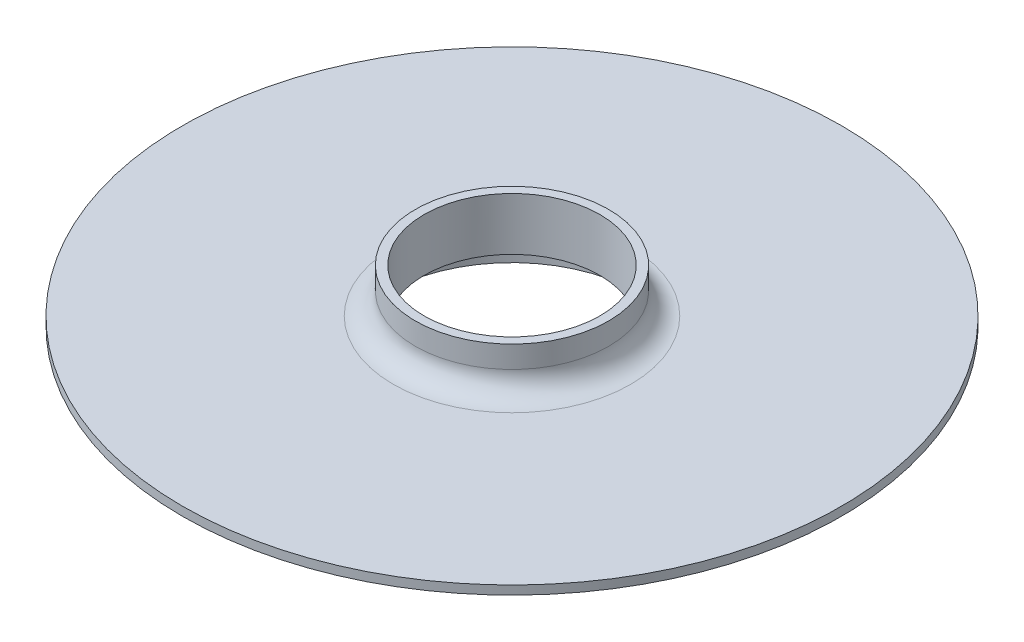
ISO-10303-21;
HEADER;
FILE_DESCRIPTION(('STEP AP214'),'2;1');
FILE_NAME('part.step','',(''),(''),'','','');
FILE_SCHEMA(('AUTOMOTIVE_DESIGN { 1 0 10303 214 1 1 1 1 }'));
ENDSEC;
DATA;
#1=APPLICATION_CONTEXT('core data for automotive mechanical design processes');
#2=APPLICATION_PROTOCOL_DEFINITION('international standard','automotive_design',2000,#1);
#3=PRODUCT_CONTEXT('',#1,'mechanical');
#4=PRODUCT('Part','Part','',(#3));
#5=PRODUCT_RELATED_PRODUCT_CATEGORY('part','',(#4));
#6=PRODUCT_DEFINITION_FORMATION('','',#4);
#7=PRODUCT_DEFINITION_CONTEXT('part definition',#1,'design');
#8=PRODUCT_DEFINITION('design','',#6,#7);
#9=PRODUCT_DEFINITION_SHAPE('','',#8);
#10=(LENGTH_UNIT() NAMED_UNIT(*) SI_UNIT(.MILLI.,.METRE.));
#11=(NAMED_UNIT(*) PLANE_ANGLE_UNIT() SI_UNIT($,.RADIAN.));
#12=(NAMED_UNIT(*) SI_UNIT($,.STERADIAN.) SOLID_ANGLE_UNIT());
#13=UNCERTAINTY_MEASURE_WITH_UNIT(LENGTH_MEASURE(1.E-05),#10,'distance_accuracy_value','');
#14=(GEOMETRIC_REPRESENTATION_CONTEXT(3) GLOBAL_UNCERTAINTY_ASSIGNED_CONTEXT((#13)) GLOBAL_UNIT_ASSIGNED_CONTEXT((#10,
#11,#12)) REPRESENTATION_CONTEXT('',''));
#15=CARTESIAN_POINT('',(0.,0.,0.));
#16=DIRECTION('',(0.,0.,1.));
#17=DIRECTION('',(1.,0.,0.));
#18=AXIS2_PLACEMENT_3D('',#15,#16,#17);
#19=CARTESIAN_POINT('',(0.,2.,0.));
#20=DIRECTION('',(0.,1.,0.));
#21=DIRECTION('',(0.,0.,1.));
#22=AXIS2_PLACEMENT_3D('',#19,#20,#21);
#23=PLANE('',#22);
#24=CARTESIAN_POINT('',(0.,2.,0.));
#25=DIRECTION('',(0.,1.,0.));
#26=DIRECTION('',(0.,0.,1.));
#27=AXIS2_PLACEMENT_3D('',#24,#25,#26);
#28=CIRCLE('',#27,27.);
#29=CARTESIAN_POINT('',(0.,2.,27.));
#30=VERTEX_POINT('',#29);
#31=EDGE_CURVE('E11',#30,#30,#28,.F.);
#32=ORIENTED_EDGE('',*,*,#31,.T.);
#33=EDGE_LOOP('',(#32));
#34=FACE_BOUND('',#33,.T.);
#35=CARTESIAN_POINT('',(0.,2.,0.));
#36=DIRECTION('',(0.,1.,0.));
#37=DIRECTION('',(0.,0.,1.));
#38=AXIS2_PLACEMENT_3D('',#35,#36,#37);
#39=CIRCLE('',#38,75.);
#40=CARTESIAN_POINT('',(0.,2.,75.));
#41=VERTEX_POINT('',#40);
#42=EDGE_CURVE('E71',#41,#41,#39,.T.);
#43=ORIENTED_EDGE('',*,*,#42,.T.);
#44=EDGE_LOOP('',(#43));
#45=FACE_BOUND('',#44,.T.);
#46=ADVANCED_FACE('F53',(#34,#45),#23,.T.);
#47=CARTESIAN_POINT('',(0.,2.,0.));
#48=DIRECTION('',(0.,-1.,0.));
#49=DIRECTION('',(0.,0.,-1.));
#50=AXIS2_PLACEMENT_3D('',#47,#48,#49);
#51=CYLINDRICAL_SURFACE('',#50,75.);
#52=ORIENTED_EDGE('',*,*,#42,.F.);
#53=EDGE_LOOP('',(#52));
#54=FACE_BOUND('',#53,.T.);
#55=CARTESIAN_POINT('',(0.,0.,0.));
#56=DIRECTION('',(0.,1.,0.));
#57=DIRECTION('',(0.,0.,1.));
#58=AXIS2_PLACEMENT_3D('',#55,#56,#57);
#59=CIRCLE('',#58,75.);
#60=CARTESIAN_POINT('',(0.,0.,75.));
#61=VERTEX_POINT('',#60);
#62=EDGE_CURVE('E74',#61,#61,#59,.T.);
#63=ORIENTED_EDGE('',*,*,#62,.T.);
#64=EDGE_LOOP('',(#63));
#65=FACE_BOUND('',#64,.T.);
#66=ADVANCED_FACE('F122',(#54,#65),#51,.T.);
#67=CARTESIAN_POINT('',(0.,0.,0.));
#68=DIRECTION('',(0.,1.,0.));
#69=DIRECTION('',(0.,0.,1.));
#70=AXIS2_PLACEMENT_3D('',#67,#68,#69);
#71=PLANE('',#70);
#72=CARTESIAN_POINT('',(0.,0.,0.));
#73=DIRECTION('',(0.,1.,0.));
#74=DIRECTION('',(0.,0.,1.));
#75=AXIS2_PLACEMENT_3D('',#72,#73,#74);
#76=CIRCLE('',#75,31.);
#77=CARTESIAN_POINT('',(0.,0.,31.));
#78=VERTEX_POINT('',#77);
#79=EDGE_CURVE('E66',#78,#78,#76,.F.);
#80=ORIENTED_EDGE('',*,*,#79,.F.);
#81=EDGE_LOOP('',(#80));
#82=FACE_BOUND('',#81,.T.);
#83=ORIENTED_EDGE('',*,*,#62,.F.);
#84=EDGE_LOOP('',(#83));
#85=FACE_BOUND('',#84,.T.);
#86=ADVANCED_FACE('F128',(#82,#85),#71,.F.);
#87=CARTESIAN_POINT('',(0.,-8.,0.));
#88=DIRECTION('',(0.,-1.,0.));
#89=DIRECTION('',(0.,0.,-1.));
#90=AXIS2_PLACEMENT_3D('',#87,#88,#89);
#91=PLANE('',#90);
#92=CARTESIAN_POINT('',(0.,-8.,0.));
#93=DIRECTION('',(0.,-1.,0.));
#94=DIRECTION('',(1.,0.,0.));
#95=AXIS2_PLACEMENT_3D('',#92,#93,#94);
#96=CIRCLE('',#95,31.);
#97=CARTESIAN_POINT('',(31.,-8.,0.));
#98=VERTEX_POINT('',#97);
#99=EDGE_CURVE('E78',#98,#98,#96,.T.);
#100=ORIENTED_EDGE('',*,*,#99,.T.);
#101=EDGE_LOOP('',(#100));
#102=FACE_BOUND('',#101,.T.);
#103=CARTESIAN_POINT('',(0.,-8.,0.));
#104=DIRECTION('',(0.,-1.,0.));
#105=DIRECTION('',(0.,0.,-1.));
#106=AXIS2_PLACEMENT_3D('',#103,#104,#105);
#107=CIRCLE('',#106,29.);
#108=CARTESIAN_POINT('',(0.,-8.,-29.));
#109=VERTEX_POINT('',#108);
#110=EDGE_CURVE('E85',#109,#109,#107,.T.);
#111=ORIENTED_EDGE('',*,*,#110,.F.);
#112=EDGE_LOOP('',(#111));
#113=FACE_BOUND('',#112,.T.);
#114=ADVANCED_FACE('F136',(#102,#113),#91,.T.);
#115=CARTESIAN_POINT('',(0.,-8.,0.));
#116=DIRECTION('',(0.,1.,0.));
#117=DIRECTION('',(0.,0.,1.));
#118=AXIS2_PLACEMENT_3D('',#115,#116,#117);
#119=CYLINDRICAL_SURFACE('',#118,31.);
#120=ORIENTED_EDGE('',*,*,#99,.F.);
#121=EDGE_LOOP('',(#120));
#122=FACE_BOUND('',#121,.T.);
#123=ORIENTED_EDGE('',*,*,#79,.T.);
#124=EDGE_LOOP('',(#123));
#125=FACE_BOUND('',#124,.T.);
#126=ADVANCED_FACE('F133',(#122,#125),#119,.T.);
#127=CARTESIAN_POINT('',(0.,-8.,0.));
#128=DIRECTION('',(0.,1.,0.));
#129=DIRECTION('',(0.,0.,1.));
#130=AXIS2_PLACEMENT_3D('',#127,#128,#129);
#131=CYLINDRICAL_SURFACE('',#130,29.);
#132=ORIENTED_EDGE('',*,*,#110,.T.);
#133=EDGE_LOOP('',(#132));
#134=FACE_BOUND('',#133,.T.);
#135=CARTESIAN_POINT('',(0.,0.,0.));
#136=DIRECTION('',(0.,-1.,0.));
#137=DIRECTION('',(0.,0.,-1.));
#138=AXIS2_PLACEMENT_3D('',#135,#136,#137);
#139=CIRCLE('',#138,29.);
#140=CARTESIAN_POINT('',(0.,0.,-29.));
#141=VERTEX_POINT('',#140);
#142=EDGE_CURVE('E86',#141,#141,#139,.T.);
#143=ORIENTED_EDGE('',*,*,#142,.F.);
#144=EDGE_LOOP('',(#143));
#145=FACE_BOUND('',#144,.T.);
#146=ADVANCED_FACE('F145',(#134,#145),#131,.F.);
#147=CARTESIAN_POINT('',(0.,0.,0.));
#148=DIRECTION('',(0.,-1.,0.));
#149=DIRECTION('',(0.,0.,-1.));
#150=AXIS2_PLACEMENT_3D('',#147,#148,#149);
#151=CIRCLE('',#150,20.);
#152=CARTESIAN_POINT('',(0.,0.,-20.));
#153=VERTEX_POINT('',#152);
#154=EDGE_CURVE('E90',#153,#153,#151,.T.);
#155=ORIENTED_EDGE('',*,*,#154,.F.);
#156=EDGE_LOOP('',(#155));
#157=FACE_BOUND('',#156,.T.);
#158=ORIENTED_EDGE('',*,*,#142,.T.);
#159=EDGE_LOOP('',(#158));
#160=FACE_BOUND('',#159,.T.);
#161=ADVANCED_FACE('F118',(#157,#160),#71,.F.);
#162=CARTESIAN_POINT('',(0.,2.,0.));
#163=DIRECTION('',(0.,-1.,0.));
#164=DIRECTION('',(0.,0.,-1.));
#165=AXIS2_PLACEMENT_3D('',#162,#163,#164);
#166=CYLINDRICAL_SURFACE('',#165,20.);
#167=ORIENTED_EDGE('',*,*,#154,.T.);
#168=EDGE_LOOP('',(#167));
#169=FACE_BOUND('',#168,.T.);
#170=CARTESIAN_POINT('',(0.,12.,0.));
#171=DIRECTION('',(0.,1.,0.));
#172=DIRECTION('',(0.,0.,1.));
#173=AXIS2_PLACEMENT_3D('',#170,#171,#172);
#174=CIRCLE('',#173,20.);
#175=CARTESIAN_POINT('',(0.,12.,20.));
#176=VERTEX_POINT('',#175);
#177=EDGE_CURVE('E101',#176,#176,#174,.T.);
#178=ORIENTED_EDGE('',*,*,#177,.T.);
#179=EDGE_LOOP('',(#178));
#180=FACE_BOUND('',#179,.T.);
#181=ADVANCED_FACE('F106',(#169,#180),#166,.F.);
#182=CARTESIAN_POINT('',(0.,12.,0.));
#183=DIRECTION('',(0.,1.,0.));
#184=DIRECTION('',(0.,0.,1.));
#185=AXIS2_PLACEMENT_3D('',#182,#183,#184);
#186=PLANE('',#185);
#187=CARTESIAN_POINT('',(0.,12.,0.));
#188=DIRECTION('',(0.,1.,0.));
#189=DIRECTION('',(1.,0.,0.));
#190=AXIS2_PLACEMENT_3D('',#187,#188,#189);
#191=CIRCLE('',#190,22.);
#192=CARTESIAN_POINT('',(22.,12.,0.));
#193=VERTEX_POINT('',#192);
#194=EDGE_CURVE('E97',#193,#193,#191,.T.);
#195=ORIENTED_EDGE('',*,*,#194,.T.);
#196=EDGE_LOOP('',(#195));
#197=FACE_BOUND('',#196,.T.);
#198=ORIENTED_EDGE('',*,*,#177,.F.);
#199=EDGE_LOOP('',(#198));
#200=FACE_BOUND('',#199,.T.);
#201=ADVANCED_FACE('F108',(#197,#200),#186,.T.);
#202=CARTESIAN_POINT('',(0.,12.,0.));
#203=DIRECTION('',(0.,-1.,0.));
#204=DIRECTION('',(0.,0.,-1.));
#205=AXIS2_PLACEMENT_3D('',#202,#203,#204);
#206=CYLINDRICAL_SURFACE('',#205,22.);
#207=CARTESIAN_POINT('',(0.,7.,0.));
#208=DIRECTION('',(0.,1.,0.));
#209=DIRECTION('',(0.,0.,1.));
#210=AXIS2_PLACEMENT_3D('',#207,#208,#209);
#211=CIRCLE('',#210,22.);
#212=CARTESIAN_POINT('',(0.,7.,22.));
#213=VERTEX_POINT('',#212);
#214=EDGE_CURVE('E61',#213,#213,#211,.T.);
#215=ORIENTED_EDGE('',*,*,#214,.T.);
#216=EDGE_LOOP('',(#215));
#217=FACE_BOUND('',#216,.T.);
#218=ORIENTED_EDGE('',*,*,#194,.F.);
#219=EDGE_LOOP('',(#218));
#220=FACE_BOUND('',#219,.T.);
#221=ADVANCED_FACE('F110',(#217,#220),#206,.T.);
#222=CARTESIAN_POINT('',(0.,7.,0.));
#223=DIRECTION('',(0.,1.,0.));
#224=DIRECTION('',(0.,0.,1.));
#225=AXIS2_PLACEMENT_3D('',#222,#223,#224);
#226=TOROIDAL_SURFACE('',#225,27.,5.);
#227=ORIENTED_EDGE('',*,*,#31,.F.);
#228=EDGE_LOOP('',(#227));
#229=FACE_BOUND('',#228,.T.);
#230=ORIENTED_EDGE('',*,*,#214,.F.);
#231=EDGE_LOOP('',(#230));
#232=FACE_BOUND('',#231,.T.);
#233=ADVANCED_FACE('F55',(#229,#232),#226,.F.);
#234=CLOSED_SHELL('',(#46,#66,#86,#114,#126,#146,#161,#181,#201,#221,#233));
#235=MANIFOLD_SOLID_BREP('B2',#234);
#236=ADVANCED_BREP_SHAPE_REPRESENTATION('',(#18,#235),#14);
#237=SHAPE_DEFINITION_REPRESENTATION(#9,#236);
ENDSEC;
END-ISO-10303-21;
